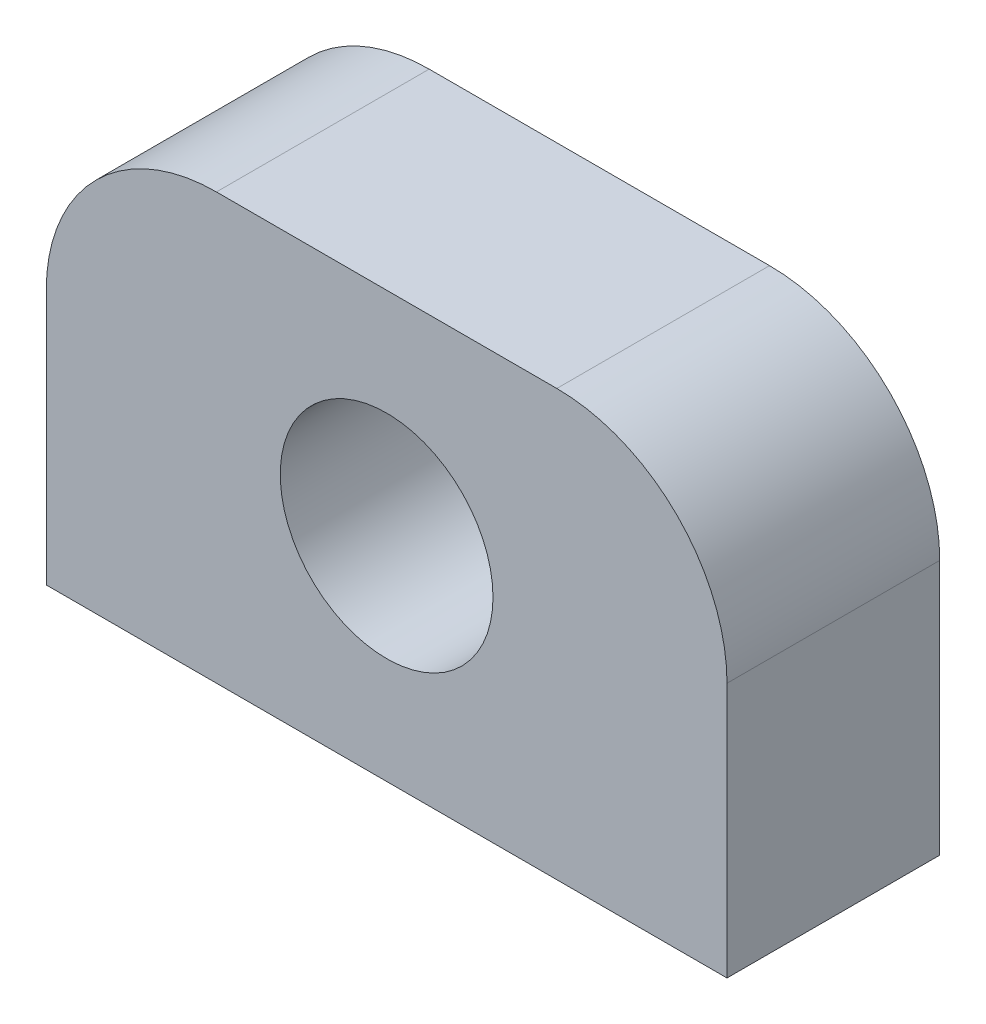
ISO-10303-21;
HEADER;
FILE_DESCRIPTION(('STEP AP214'),'2;1');
FILE_NAME('part.step','',(''),(''),'','','');
FILE_SCHEMA(('AUTOMOTIVE_DESIGN { 1 0 10303 214 1 1 1 1 }'));
ENDSEC;
DATA;
#1=APPLICATION_CONTEXT('core data for automotive mechanical design processes');
#2=APPLICATION_PROTOCOL_DEFINITION('international standard','automotive_design',2000,#1);
#3=PRODUCT_CONTEXT('',#1,'mechanical');
#4=PRODUCT('Part','Part','',(#3));
#5=PRODUCT_RELATED_PRODUCT_CATEGORY('part','',(#4));
#6=PRODUCT_DEFINITION_FORMATION('','',#4);
#7=PRODUCT_DEFINITION_CONTEXT('part definition',#1,'design');
#8=PRODUCT_DEFINITION('design','',#6,#7);
#9=PRODUCT_DEFINITION_SHAPE('','',#8);
#10=(LENGTH_UNIT() NAMED_UNIT(*) SI_UNIT(.MILLI.,.METRE.));
#11=(NAMED_UNIT(*) PLANE_ANGLE_UNIT() SI_UNIT($,.RADIAN.));
#12=(NAMED_UNIT(*) SI_UNIT($,.STERADIAN.) SOLID_ANGLE_UNIT());
#13=UNCERTAINTY_MEASURE_WITH_UNIT(LENGTH_MEASURE(1.E-05),#10,'distance_accuracy_value','');
#14=(GEOMETRIC_REPRESENTATION_CONTEXT(3) GLOBAL_UNCERTAINTY_ASSIGNED_CONTEXT((#13)) GLOBAL_UNIT_ASSIGNED_CONTEXT((#10,
#11,#12)) REPRESENTATION_CONTEXT('',''));
#15=CARTESIAN_POINT('',(0.,0.,0.));
#16=DIRECTION('',(0.,0.,1.));
#17=DIRECTION('',(1.,0.,0.));
#18=AXIS2_PLACEMENT_3D('',#15,#16,#17);
#19=CARTESIAN_POINT('',(5.08,7.62,6.35));
#20=DIRECTION('',(0.,0.,1.));
#21=DIRECTION('',(1.,0.,0.));
#22=AXIS2_PLACEMENT_3D('',#19,#20,#21);
#23=PLANE('',#22);
#24=DIRECTION('',(0.,-1.,0.));
#25=VECTOR('',#24,1.);
#26=CARTESIAN_POINT('',(0.,0.,6.35));
#27=LINE('',#26,#25);
#28=CARTESIAN_POINT('',(0.,7.61999999999997,6.35));
#29=VERTEX_POINT('',#28);
#30=CARTESIAN_POINT('',(0.,0.,6.35));
#31=VERTEX_POINT('',#30);
#32=EDGE_CURVE('E150',#29,#31,#27,.T.);
#33=ORIENTED_EDGE('',*,*,#32,.T.);
#34=DIRECTION('',(1.,0.,0.));
#35=VECTOR('',#34,1.);
#36=CARTESIAN_POINT('',(0.,0.,6.35));
#37=LINE('',#36,#35);
#38=CARTESIAN_POINT('',(20.32,0.,6.35));
#39=VERTEX_POINT('',#38);
#40=EDGE_CURVE('E98',#31,#39,#37,.T.);
#41=ORIENTED_EDGE('',*,*,#40,.T.);
#42=DIRECTION('',(0.,1.,0.));
#43=VECTOR('',#42,1.);
#44=CARTESIAN_POINT('',(20.32,0.,6.35));
#45=LINE('',#44,#43);
#46=CARTESIAN_POINT('',(20.32,7.61999999999996,6.35));
#47=VERTEX_POINT('',#46);
#48=EDGE_CURVE('E111',#39,#47,#45,.T.);
#49=ORIENTED_EDGE('',*,*,#48,.T.);
#50=CARTESIAN_POINT('',(15.24,7.62,6.35));
#51=DIRECTION('',(0.,0.,1.));
#52=DIRECTION('',(1.,0.,0.));
#53=AXIS2_PLACEMENT_3D('',#50,#51,#52);
#54=CIRCLE('',#53,5.08);
#55=CARTESIAN_POINT('',(15.24,12.7,6.35));
#56=VERTEX_POINT('',#55);
#57=EDGE_CURVE('E105',#47,#56,#54,.T.);
#58=ORIENTED_EDGE('',*,*,#57,.T.);
#59=DIRECTION('',(-1.,0.,0.));
#60=VECTOR('',#59,1.);
#61=CARTESIAN_POINT('',(5.08000000000004,12.7,6.35));
#62=LINE('',#61,#60);
#63=CARTESIAN_POINT('',(5.08000000000004,12.7,6.35));
#64=VERTEX_POINT('',#63);
#65=EDGE_CURVE('E109',#56,#64,#62,.T.);
#66=ORIENTED_EDGE('',*,*,#65,.T.);
#67=CARTESIAN_POINT('',(5.08,7.62,6.35));
#68=DIRECTION('',(0.,0.,1.));
#69=DIRECTION('',(1.,0.,0.));
#70=AXIS2_PLACEMENT_3D('',#67,#68,#69);
#71=CIRCLE('',#70,5.08);
#72=EDGE_CURVE('E61',#64,#29,#71,.T.);
#73=ORIENTED_EDGE('',*,*,#72,.T.);
#74=EDGE_LOOP('',(#33,#41,#49,#58,#66,#73));
#75=FACE_BOUND('',#74,.T.);
#76=CARTESIAN_POINT('',(10.16,6.35,6.35));
#77=DIRECTION('',(0.,0.,1.));
#78=DIRECTION('',(1.,0.,0.));
#79=AXIS2_PLACEMENT_3D('',#76,#77,#78);
#80=CIRCLE('',#79,3.175);
#81=CARTESIAN_POINT('',(13.335,6.35,6.35));
#82=VERTEX_POINT('',#81);
#83=EDGE_CURVE('E138',#82,#82,#80,.T.);
#84=ORIENTED_EDGE('',*,*,#83,.F.);
#85=EDGE_LOOP('',(#84));
#86=FACE_BOUND('',#85,.T.);
#87=ADVANCED_FACE('F43',(#75,#86),#23,.T.);
#88=CARTESIAN_POINT('',(5.08,7.62,0.));
#89=DIRECTION('',(0.,0.,1.));
#90=DIRECTION('',(1.,0.,0.));
#91=AXIS2_PLACEMENT_3D('',#88,#89,#90);
#92=PLANE('',#91);
#93=DIRECTION('',(0.,-1.,0.));
#94=VECTOR('',#93,1.);
#95=CARTESIAN_POINT('',(0.,0.,0.));
#96=LINE('',#95,#94);
#97=CARTESIAN_POINT('',(0.,7.61999999999997,0.));
#98=VERTEX_POINT('',#97);
#99=CARTESIAN_POINT('',(0.,0.,0.));
#100=VERTEX_POINT('',#99);
#101=EDGE_CURVE('E133',#98,#100,#96,.T.);
#102=ORIENTED_EDGE('',*,*,#101,.F.);
#103=CARTESIAN_POINT('',(5.08,7.62,0.));
#104=DIRECTION('',(0.,0.,1.));
#105=DIRECTION('',(1.,0.,0.));
#106=AXIS2_PLACEMENT_3D('',#103,#104,#105);
#107=CIRCLE('',#106,5.08);
#108=CARTESIAN_POINT('',(5.08000000000004,12.7,0.));
#109=VERTEX_POINT('',#108);
#110=EDGE_CURVE('E90',#109,#98,#107,.T.);
#111=ORIENTED_EDGE('',*,*,#110,.F.);
#112=DIRECTION('',(-1.,0.,0.));
#113=VECTOR('',#112,1.);
#114=CARTESIAN_POINT('',(5.08000000000004,12.7,0.));
#115=LINE('',#114,#113);
#116=CARTESIAN_POINT('',(15.24,12.7,0.));
#117=VERTEX_POINT('',#116);
#118=EDGE_CURVE('E84',#117,#109,#115,.T.);
#119=ORIENTED_EDGE('',*,*,#118,.F.);
#120=CARTESIAN_POINT('',(15.24,7.62,0.));
#121=DIRECTION('',(0.,0.,1.));
#122=DIRECTION('',(1.,0.,0.));
#123=AXIS2_PLACEMENT_3D('',#120,#121,#122);
#124=CIRCLE('',#123,5.08);
#125=CARTESIAN_POINT('',(20.32,7.61999999999996,0.));
#126=VERTEX_POINT('',#125);
#127=EDGE_CURVE('E120',#126,#117,#124,.T.);
#128=ORIENTED_EDGE('',*,*,#127,.F.);
#129=DIRECTION('',(0.,1.,0.));
#130=VECTOR('',#129,1.);
#131=CARTESIAN_POINT('',(20.32,0.,0.));
#132=LINE('',#131,#130);
#133=CARTESIAN_POINT('',(20.32,0.,0.));
#134=VERTEX_POINT('',#133);
#135=EDGE_CURVE('E141',#134,#126,#132,.T.);
#136=ORIENTED_EDGE('',*,*,#135,.F.);
#137=DIRECTION('',(1.,0.,0.));
#138=VECTOR('',#137,1.);
#139=CARTESIAN_POINT('',(0.,0.,0.));
#140=LINE('',#139,#138);
#141=EDGE_CURVE('E137',#100,#134,#140,.T.);
#142=ORIENTED_EDGE('',*,*,#141,.F.);
#143=EDGE_LOOP('',(#102,#111,#119,#128,#136,#142));
#144=FACE_BOUND('',#143,.T.);
#145=CARTESIAN_POINT('',(10.16,6.35,0.));
#146=DIRECTION('',(0.,0.,1.));
#147=DIRECTION('',(1.,0.,0.));
#148=AXIS2_PLACEMENT_3D('',#145,#146,#147);
#149=CIRCLE('',#148,3.175);
#150=CARTESIAN_POINT('',(13.335,6.35,0.));
#151=VERTEX_POINT('',#150);
#152=EDGE_CURVE('E265',#151,#151,#149,.T.);
#153=ORIENTED_EDGE('',*,*,#152,.T.);
#154=EDGE_LOOP('',(#153));
#155=FACE_BOUND('',#154,.T.);
#156=ADVANCED_FACE('F163',(#144,#155),#92,.F.);
#157=CARTESIAN_POINT('',(0.,0.,6.35));
#158=DIRECTION('',(1.,0.,0.));
#159=DIRECTION('',(0.,0.,-1.));
#160=AXIS2_PLACEMENT_3D('',#157,#158,#159);
#161=PLANE('',#160);
#162=ORIENTED_EDGE('',*,*,#101,.T.);
#163=DIRECTION('',(0.,0.,-1.));
#164=VECTOR('',#163,1.);
#165=CARTESIAN_POINT('',(0.,0.,6.35));
#166=LINE('',#165,#164);
#167=EDGE_CURVE('E11',#31,#100,#166,.T.);
#168=ORIENTED_EDGE('',*,*,#167,.F.);
#169=ORIENTED_EDGE('',*,*,#32,.F.);
#170=DIRECTION('',(0.,0.,-1.));
#171=VECTOR('',#170,1.);
#172=CARTESIAN_POINT('',(0.,7.61999999999997,6.35));
#173=LINE('',#172,#171);
#174=EDGE_CURVE('E129',#29,#98,#173,.T.);
#175=ORIENTED_EDGE('',*,*,#174,.T.);
#176=EDGE_LOOP('',(#162,#168,#169,#175));
#177=FACE_BOUND('',#176,.T.);
#178=ADVANCED_FACE('F45',(#177),#161,.F.);
#179=CARTESIAN_POINT('',(0.,0.,6.35));
#180=DIRECTION('',(0.,1.,0.));
#181=DIRECTION('',(0.,0.,1.));
#182=AXIS2_PLACEMENT_3D('',#179,#180,#181);
#183=PLANE('',#182);
#184=ORIENTED_EDGE('',*,*,#141,.T.);
#185=DIRECTION('',(0.,0.,-1.));
#186=VECTOR('',#185,1.);
#187=CARTESIAN_POINT('',(20.32,0.,6.35));
#188=LINE('',#187,#186);
#189=EDGE_CURVE('E53',#39,#134,#188,.T.);
#190=ORIENTED_EDGE('',*,*,#189,.F.);
#191=ORIENTED_EDGE('',*,*,#40,.F.);
#192=ORIENTED_EDGE('',*,*,#167,.T.);
#193=EDGE_LOOP('',(#184,#190,#191,#192));
#194=FACE_BOUND('',#193,.T.);
#195=ADVANCED_FACE('F188',(#194),#183,.F.);
#196=CARTESIAN_POINT('',(20.32,0.,6.35));
#197=DIRECTION('',(-1.,0.,0.));
#198=DIRECTION('',(0.,0.,1.));
#199=AXIS2_PLACEMENT_3D('',#196,#197,#198);
#200=PLANE('',#199);
#201=ORIENTED_EDGE('',*,*,#135,.T.);
#202=DIRECTION('',(0.,0.,-1.));
#203=VECTOR('',#202,1.);
#204=CARTESIAN_POINT('',(20.32,7.61999999999996,6.35));
#205=LINE('',#204,#203);
#206=EDGE_CURVE('E122',#47,#126,#205,.T.);
#207=ORIENTED_EDGE('',*,*,#206,.F.);
#208=ORIENTED_EDGE('',*,*,#48,.F.);
#209=ORIENTED_EDGE('',*,*,#189,.T.);
#210=EDGE_LOOP('',(#201,#207,#208,#209));
#211=FACE_BOUND('',#210,.T.);
#212=ADVANCED_FACE('F160',(#211),#200,.F.);
#213=CARTESIAN_POINT('',(15.24,7.62,6.35));
#214=DIRECTION('',(0.,0.,-1.));
#215=DIRECTION('',(-1.,0.,0.));
#216=AXIS2_PLACEMENT_3D('',#213,#214,#215);
#217=CYLINDRICAL_SURFACE('',#216,5.08);
#218=ORIENTED_EDGE('',*,*,#127,.T.);
#219=DIRECTION('',(0.,0.,-1.));
#220=VECTOR('',#219,1.);
#221=CARTESIAN_POINT('',(15.24,12.7,6.35));
#222=LINE('',#221,#220);
#223=EDGE_CURVE('E117',#56,#117,#222,.T.);
#224=ORIENTED_EDGE('',*,*,#223,.F.);
#225=ORIENTED_EDGE('',*,*,#57,.F.);
#226=ORIENTED_EDGE('',*,*,#206,.T.);
#227=EDGE_LOOP('',(#218,#224,#225,#226));
#228=FACE_BOUND('',#227,.T.);
#229=ADVANCED_FACE('F118',(#228),#217,.T.);
#230=CARTESIAN_POINT('',(5.08000000000004,12.7,6.35));
#231=DIRECTION('',(0.,-1.,0.));
#232=DIRECTION('',(0.,0.,-1.));
#233=AXIS2_PLACEMENT_3D('',#230,#231,#232);
#234=PLANE('',#233);
#235=ORIENTED_EDGE('',*,*,#118,.T.);
#236=DIRECTION('',(0.,0.,-1.));
#237=VECTOR('',#236,1.);
#238=CARTESIAN_POINT('',(5.08000000000004,12.7,6.35));
#239=LINE('',#238,#237);
#240=EDGE_CURVE('E123',#64,#109,#239,.T.);
#241=ORIENTED_EDGE('',*,*,#240,.F.);
#242=ORIENTED_EDGE('',*,*,#65,.F.);
#243=ORIENTED_EDGE('',*,*,#223,.T.);
#244=EDGE_LOOP('',(#235,#241,#242,#243));
#245=FACE_BOUND('',#244,.T.);
#246=ADVANCED_FACE('F125',(#245),#234,.F.);
#247=CARTESIAN_POINT('',(5.08,7.62,6.35));
#248=DIRECTION('',(0.,0.,-1.));
#249=DIRECTION('',(-1.,0.,0.));
#250=AXIS2_PLACEMENT_3D('',#247,#248,#249);
#251=CYLINDRICAL_SURFACE('',#250,5.08);
#252=ORIENTED_EDGE('',*,*,#110,.T.);
#253=ORIENTED_EDGE('',*,*,#174,.F.);
#254=ORIENTED_EDGE('',*,*,#72,.F.);
#255=ORIENTED_EDGE('',*,*,#240,.T.);
#256=EDGE_LOOP('',(#252,#253,#254,#255));
#257=FACE_BOUND('',#256,.T.);
#258=ADVANCED_FACE('F168',(#257),#251,.T.);
#259=CARTESIAN_POINT('',(10.16,6.35,6.35));
#260=DIRECTION('',(0.,0.,-1.));
#261=DIRECTION('',(-1.,0.,0.));
#262=AXIS2_PLACEMENT_3D('',#259,#260,#261);
#263=CYLINDRICAL_SURFACE('',#262,3.175);
#264=ORIENTED_EDGE('',*,*,#83,.T.);
#265=EDGE_LOOP('',(#264));
#266=FACE_BOUND('',#265,.T.);
#267=ORIENTED_EDGE('',*,*,#152,.F.);
#268=EDGE_LOOP('',(#267));
#269=FACE_BOUND('',#268,.T.);
#270=ADVANCED_FACE('F170',(#266,#269),#263,.F.);
#271=CLOSED_SHELL('',(#87,#156,#178,#195,#212,#229,#246,#258,#270));
#272=MANIFOLD_SOLID_BREP('B2',#271);
#273=ADVANCED_BREP_SHAPE_REPRESENTATION('',(#18,#272),#14);
#274=SHAPE_DEFINITION_REPRESENTATION(#9,#273);
ENDSEC;
END-ISO-10303-21;
